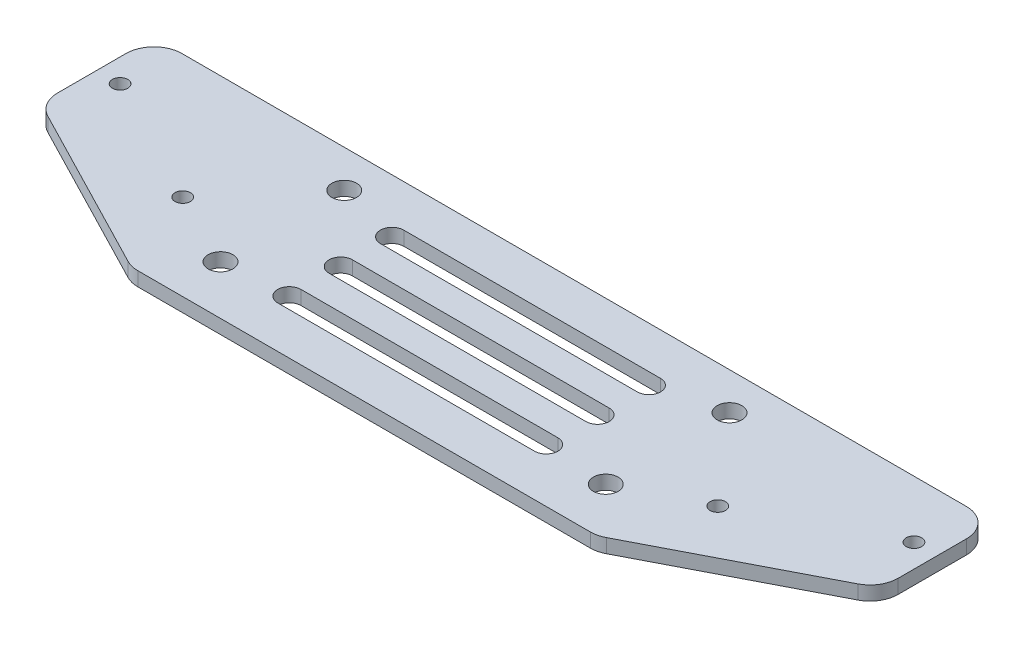
ISO-10303-21;
HEADER;
FILE_DESCRIPTION(('STEP AP214'),'2;1');
FILE_NAME('part.step','',(''),(''),'','','');
FILE_SCHEMA(('AUTOMOTIVE_DESIGN { 1 0 10303 214 1 1 1 1 }'));
ENDSEC;
DATA;
#1=APPLICATION_CONTEXT('core data for automotive mechanical design processes');
#2=APPLICATION_PROTOCOL_DEFINITION('international standard','automotive_design',2000,#1);
#3=PRODUCT_CONTEXT('',#1,'mechanical');
#4=PRODUCT('Part','Part','',(#3));
#5=PRODUCT_RELATED_PRODUCT_CATEGORY('part','',(#4));
#6=PRODUCT_DEFINITION_FORMATION('','',#4);
#7=PRODUCT_DEFINITION_CONTEXT('part definition',#1,'design');
#8=PRODUCT_DEFINITION('design','',#6,#7);
#9=PRODUCT_DEFINITION_SHAPE('','',#8);
#10=(LENGTH_UNIT() NAMED_UNIT(*) SI_UNIT(.MILLI.,.METRE.));
#11=(NAMED_UNIT(*) PLANE_ANGLE_UNIT() SI_UNIT($,.RADIAN.));
#12=(NAMED_UNIT(*) SI_UNIT($,.STERADIAN.) SOLID_ANGLE_UNIT());
#13=UNCERTAINTY_MEASURE_WITH_UNIT(LENGTH_MEASURE(1.E-05),#10,'distance_accuracy_value','');
#14=(GEOMETRIC_REPRESENTATION_CONTEXT(3) GLOBAL_UNCERTAINTY_ASSIGNED_CONTEXT((#13)) GLOBAL_UNIT_ASSIGNED_CONTEXT((#10,
#11,#12)) REPRESENTATION_CONTEXT('',''));
#15=CARTESIAN_POINT('',(0.,0.,0.));
#16=DIRECTION('',(0.,0.,1.));
#17=DIRECTION('',(1.,0.,0.));
#18=AXIS2_PLACEMENT_3D('',#15,#16,#17);
#19=CARTESIAN_POINT('',(0.,3.,0.));
#20=DIRECTION('',(0.,1.,0.));
#21=DIRECTION('',(0.,0.,1.));
#22=AXIS2_PLACEMENT_3D('',#19,#20,#21);
#23=PLANE('',#22);
#24=CARTESIAN_POINT('',(-27.5,3.,-9.75000000000002));
#25=DIRECTION('',(0.,1.,0.));
#26=DIRECTION('',(0.,0.,1.));
#27=AXIS2_PLACEMENT_3D('',#24,#25,#26);
#28=CIRCLE('',#27,2.5);
#29=CARTESIAN_POINT('',(-27.5,3.,-12.25));
#30=VERTEX_POINT('',#29);
#31=CARTESIAN_POINT('',(-27.5,3.,-7.25000000000002));
#32=VERTEX_POINT('',#31);
#33=EDGE_CURVE('E49',#30,#32,#28,.T.);
#34=ORIENTED_EDGE('',*,*,#33,.F.);
#35=DIRECTION('',(-1.,0.,0.));
#36=VECTOR('',#35,1.);
#37=CARTESIAN_POINT('',(-27.5,3.,-12.25));
#38=LINE('',#37,#36);
#39=CARTESIAN_POINT('',(27.5,3.,-12.25));
#40=VERTEX_POINT('',#39);
#41=EDGE_CURVE('E216',#40,#30,#38,.T.);
#42=ORIENTED_EDGE('',*,*,#41,.F.);
#43=CARTESIAN_POINT('',(27.5,3.,-9.75000000000001));
#44=DIRECTION('',(0.,1.,0.));
#45=DIRECTION('',(0.,0.,1.));
#46=AXIS2_PLACEMENT_3D('',#43,#44,#45);
#47=CIRCLE('',#46,2.5);
#48=CARTESIAN_POINT('',(27.5,3.,-7.25000000000001));
#49=VERTEX_POINT('',#48);
#50=EDGE_CURVE('E219',#49,#40,#47,.T.);
#51=ORIENTED_EDGE('',*,*,#50,.F.);
#52=DIRECTION('',(1.,0.,0.));
#53=VECTOR('',#52,1.);
#54=CARTESIAN_POINT('',(-27.5,3.,-7.25000000000002));
#55=LINE('',#54,#53);
#56=EDGE_CURVE('E225',#32,#49,#55,.T.);
#57=ORIENTED_EDGE('',*,*,#56,.F.);
#58=EDGE_LOOP('',(#34,#42,#51,#57));
#59=FACE_BOUND('',#58,.T.);
#60=CARTESIAN_POINT('',(-27.5,3.,1.24999999999998));
#61=DIRECTION('',(0.,1.,0.));
#62=DIRECTION('',(0.,0.,1.));
#63=AXIS2_PLACEMENT_3D('',#60,#61,#62);
#64=CIRCLE('',#63,2.5);
#65=CARTESIAN_POINT('',(-27.5,3.,-1.25000000000002));
#66=VERTEX_POINT('',#65);
#67=CARTESIAN_POINT('',(-27.5,3.,3.74999999999998));
#68=VERTEX_POINT('',#67);
#69=EDGE_CURVE('E57',#66,#68,#64,.T.);
#70=ORIENTED_EDGE('',*,*,#69,.F.);
#71=DIRECTION('',(-1.,0.,0.));
#72=VECTOR('',#71,1.);
#73=CARTESIAN_POINT('',(-27.5,3.,-1.25000000000002));
#74=LINE('',#73,#72);
#75=CARTESIAN_POINT('',(27.5,3.,-1.25000000000003));
#76=VERTEX_POINT('',#75);
#77=EDGE_CURVE('E240',#76,#66,#74,.T.);
#78=ORIENTED_EDGE('',*,*,#77,.F.);
#79=CARTESIAN_POINT('',(27.5,3.,1.24999999999997));
#80=DIRECTION('',(0.,1.,0.));
#81=DIRECTION('',(0.,0.,1.));
#82=AXIS2_PLACEMENT_3D('',#79,#80,#81);
#83=CIRCLE('',#82,2.5);
#84=CARTESIAN_POINT('',(27.5,3.,3.74999999999997));
#85=VERTEX_POINT('',#84);
#86=EDGE_CURVE('E255',#85,#76,#83,.T.);
#87=ORIENTED_EDGE('',*,*,#86,.F.);
#88=DIRECTION('',(1.,0.,0.));
#89=VECTOR('',#88,1.);
#90=CARTESIAN_POINT('',(-27.5,3.,3.74999999999998));
#91=LINE('',#90,#89);
#92=EDGE_CURVE('E251',#68,#85,#91,.T.);
#93=ORIENTED_EDGE('',*,*,#92,.F.);
#94=EDGE_LOOP('',(#70,#78,#87,#93));
#95=FACE_BOUND('',#94,.T.);
#96=CARTESIAN_POINT('',(-27.5,3.,12.25));
#97=DIRECTION('',(0.,1.,0.));
#98=DIRECTION('',(0.,0.,1.));
#99=AXIS2_PLACEMENT_3D('',#96,#97,#98);
#100=CIRCLE('',#99,2.5);
#101=CARTESIAN_POINT('',(-27.5,3.,9.75));
#102=VERTEX_POINT('',#101);
#103=CARTESIAN_POINT('',(-27.5,3.,14.75));
#104=VERTEX_POINT('',#103);
#105=EDGE_CURVE('E280',#102,#104,#100,.T.);
#106=ORIENTED_EDGE('',*,*,#105,.F.);
#107=DIRECTION('',(-1.,0.,0.));
#108=VECTOR('',#107,1.);
#109=CARTESIAN_POINT('',(-27.5,3.,9.75));
#110=LINE('',#109,#108);
#111=CARTESIAN_POINT('',(27.5,3.,9.74999999999999));
#112=VERTEX_POINT('',#111);
#113=EDGE_CURVE('E270',#112,#102,#110,.T.);
#114=ORIENTED_EDGE('',*,*,#113,.F.);
#115=CARTESIAN_POINT('',(27.5,3.,12.25));
#116=DIRECTION('',(0.,1.,0.));
#117=DIRECTION('',(0.,0.,1.));
#118=AXIS2_PLACEMENT_3D('',#115,#116,#117);
#119=CIRCLE('',#118,2.5);
#120=CARTESIAN_POINT('',(27.5,3.,14.75));
#121=VERTEX_POINT('',#120);
#122=EDGE_CURVE('E285',#121,#112,#119,.T.);
#123=ORIENTED_EDGE('',*,*,#122,.F.);
#124=DIRECTION('',(1.,0.,0.));
#125=VECTOR('',#124,1.);
#126=CARTESIAN_POINT('',(-27.5,3.,14.75));
#127=LINE('',#126,#125);
#128=EDGE_CURVE('E282',#104,#121,#127,.T.);
#129=ORIENTED_EDGE('',*,*,#128,.F.);
#130=EDGE_LOOP('',(#106,#114,#123,#129));
#131=FACE_BOUND('',#130,.T.);
#132=DIRECTION('',(1.,0.,0.));
#133=VECTOR('',#132,1.);
#134=CARTESIAN_POINT('',(-90.,3.,23.75));
#135=LINE('',#134,#133);
#136=CARTESIAN_POINT('',(-48.4432659156992,3.,23.75));
#137=VERTEX_POINT('',#136);
#138=CARTESIAN_POINT('',(48.4432659156991,3.,23.75));
#139=VERTEX_POINT('',#138);
#140=EDGE_CURVE('E367',#137,#139,#135,.T.);
#141=ORIENTED_EDGE('',*,*,#140,.T.);
#142=CARTESIAN_POINT('',(48.4432659156992,3.,17.75));
#143=DIRECTION('',(0.,1.,0.));
#144=DIRECTION('',(0.,0.,1.));
#145=AXIS2_PLACEMENT_3D('',#142,#143,#144);
#146=CIRCLE('',#145,6.);
#147=CARTESIAN_POINT('',(51.1956136961503,3.,23.0814708754194));
#148=VERTEX_POINT('',#147);
#149=EDGE_CURVE('E395',#139,#148,#146,.T.);
#150=ORIENTED_EDGE('',*,*,#149,.T.);
#151=DIRECTION('',(-0.888578479236569,0.,0.458724630075197));
#152=VECTOR('',#151,1.);
#153=CARTESIAN_POINT('',(49.9006307065782,3.,23.75));
#154=LINE('',#153,#152);
#155=CARTESIAN_POINT('',(86.7523477804512,3.,4.72546735897526));
#156=VERTEX_POINT('',#155);
#157=EDGE_CURVE('E232',#156,#148,#154,.T.);
#158=ORIENTED_EDGE('',*,*,#157,.F.);
#159=CARTESIAN_POINT('',(84.,3.,-0.606003516444145));
#160=DIRECTION('',(0.,1.,0.));
#161=DIRECTION('',(0.,0.,1.));
#162=AXIS2_PLACEMENT_3D('',#159,#160,#161);
#163=CIRCLE('',#162,6.);
#164=CARTESIAN_POINT('',(90.0000000000001,3.,-0.606003516444149));
#165=VERTEX_POINT('',#164);
#166=EDGE_CURVE('E393',#156,#165,#163,.T.);
#167=ORIENTED_EDGE('',*,*,#166,.T.);
#168=DIRECTION('',(0.,0.,-1.));
#169=VECTOR('',#168,1.);
#170=CARTESIAN_POINT('',(90.0000000000001,3.,-21.25));
#171=LINE('',#170,#169);
#172=CARTESIAN_POINT('',(90.0000000000001,3.,-15.25));
#173=VERTEX_POINT('',#172);
#174=EDGE_CURVE('E357',#165,#173,#171,.T.);
#175=ORIENTED_EDGE('',*,*,#174,.T.);
#176=CARTESIAN_POINT('',(84.,3.,-15.25));
#177=DIRECTION('',(0.,1.,0.));
#178=DIRECTION('',(0.,0.,1.));
#179=AXIS2_PLACEMENT_3D('',#176,#177,#178);
#180=CIRCLE('',#179,6.);
#181=CARTESIAN_POINT('',(84.,3.,-21.25));
#182=VERTEX_POINT('',#181);
#183=EDGE_CURVE('E391',#173,#182,#180,.T.);
#184=ORIENTED_EDGE('',*,*,#183,.T.);
#185=DIRECTION('',(-1.,0.,0.));
#186=VECTOR('',#185,1.);
#187=CARTESIAN_POINT('',(-90.,3.,-21.25));
#188=LINE('',#187,#186);
#189=CARTESIAN_POINT('',(-84.,3.,-21.25));
#190=VERTEX_POINT('',#189);
#191=EDGE_CURVE('E360',#182,#190,#188,.T.);
#192=ORIENTED_EDGE('',*,*,#191,.T.);
#193=CARTESIAN_POINT('',(-84.,3.,-15.25));
#194=DIRECTION('',(0.,1.,0.));
#195=DIRECTION('',(0.,0.,1.));
#196=AXIS2_PLACEMENT_3D('',#193,#194,#195);
#197=CIRCLE('',#196,6.);
#198=CARTESIAN_POINT('',(-90.,3.,-15.25));
#199=VERTEX_POINT('',#198);
#200=EDGE_CURVE('E389',#190,#199,#197,.T.);
#201=ORIENTED_EDGE('',*,*,#200,.T.);
#202=DIRECTION('',(0.,0.,1.));
#203=VECTOR('',#202,1.);
#204=CARTESIAN_POINT('',(-90.,3.,-21.25));
#205=LINE('',#204,#203);
#206=CARTESIAN_POINT('',(-90.,3.,-0.606003516444093));
#207=VERTEX_POINT('',#206);
#208=EDGE_CURVE('E364',#199,#207,#205,.T.);
#209=ORIENTED_EDGE('',*,*,#208,.T.);
#210=CARTESIAN_POINT('',(-84.,3.,-0.60600351644409));
#211=DIRECTION('',(0.,1.,0.));
#212=DIRECTION('',(0.,0.,1.));
#213=AXIS2_PLACEMENT_3D('',#210,#211,#212);
#214=CIRCLE('',#213,6.);
#215=CARTESIAN_POINT('',(-86.7523477804512,3.,4.72546735897532));
#216=VERTEX_POINT('',#215);
#217=EDGE_CURVE('E385',#207,#216,#214,.T.);
#218=ORIENTED_EDGE('',*,*,#217,.T.);
#219=DIRECTION('',(-0.888578479236569,0.,-0.458724630075196));
#220=VECTOR('',#219,1.);
#221=CARTESIAN_POINT('',(-49.9006307065782,3.,23.75));
#222=LINE('',#221,#220);
#223=CARTESIAN_POINT('',(-51.1956136961503,3.,23.0814708754194));
#224=VERTEX_POINT('',#223);
#225=EDGE_CURVE('E301',#224,#216,#222,.T.);
#226=ORIENTED_EDGE('',*,*,#225,.F.);
#227=CARTESIAN_POINT('',(-48.4432659156992,3.,17.75));
#228=DIRECTION('',(0.,1.,0.));
#229=DIRECTION('',(0.,0.,1.));
#230=AXIS2_PLACEMENT_3D('',#227,#228,#229);
#231=CIRCLE('',#230,6.);
#232=EDGE_CURVE('E387',#224,#137,#231,.T.);
#233=ORIENTED_EDGE('',*,*,#232,.T.);
#234=EDGE_LOOP('',(#141,#150,#158,#167,#175,#184,#192,#201,#209,#218,#226,#233));
#235=FACE_BOUND('',#234,.T.);
#236=CARTESIAN_POINT('',(-85.,3.,-8.99999999999999));
#237=DIRECTION('',(0.,1.,0.));
#238=DIRECTION('',(0.,0.,1.));
#239=AXIS2_PLACEMENT_3D('',#236,#237,#238);
#240=CIRCLE('',#239,1.65);
#241=CARTESIAN_POINT('',(-85.,3.,-7.34999999999999));
#242=VERTEX_POINT('',#241);
#243=EDGE_CURVE('E313',#242,#242,#240,.T.);
#244=ORIENTED_EDGE('',*,*,#243,.F.);
#245=EDGE_LOOP('',(#244));
#246=FACE_BOUND('',#245,.T.);
#247=CARTESIAN_POINT('',(57.3,3.,5.29999999999999));
#248=DIRECTION('',(0.,1.,0.));
#249=DIRECTION('',(0.,0.,-1.));
#250=AXIS2_PLACEMENT_3D('',#247,#248,#249);
#251=CIRCLE('',#250,1.65);
#252=CARTESIAN_POINT('',(57.3,3.,3.65));
#253=VERTEX_POINT('',#252);
#254=EDGE_CURVE('E300',#253,#253,#251,.T.);
#255=ORIENTED_EDGE('',*,*,#254,.F.);
#256=EDGE_LOOP('',(#255));
#257=FACE_BOUND('',#256,.T.);
#258=CARTESIAN_POINT('',(-57.3,3.,5.30000000000001));
#259=DIRECTION('',(0.,1.,0.));
#260=DIRECTION('',(0.,0.,1.));
#261=AXIS2_PLACEMENT_3D('',#258,#259,#260);
#262=CIRCLE('',#261,1.65);
#263=CARTESIAN_POINT('',(-57.3,3.,6.95));
#264=VERTEX_POINT('',#263);
#265=EDGE_CURVE('E320',#264,#264,#262,.T.);
#266=ORIENTED_EDGE('',*,*,#265,.F.);
#267=EDGE_LOOP('',(#266));
#268=FACE_BOUND('',#267,.T.);
#269=CARTESIAN_POINT('',(85.,3.,-9.00000000000001));
#270=DIRECTION('',(0.,1.,0.));
#271=DIRECTION('',(0.,0.,-1.));
#272=AXIS2_PLACEMENT_3D('',#269,#270,#271);
#273=CIRCLE('',#272,1.65);
#274=CARTESIAN_POINT('',(85.,3.,-10.65));
#275=VERTEX_POINT('',#274);
#276=EDGE_CURVE('E325',#275,#275,#273,.T.);
#277=ORIENTED_EDGE('',*,*,#276,.F.);
#278=EDGE_LOOP('',(#277));
#279=FACE_BOUND('',#278,.T.);
#280=CARTESIAN_POINT('',(-41.25,3.,13.25));
#281=DIRECTION('',(0.,1.,0.));
#282=DIRECTION('',(0.,0.,1.));
#283=AXIS2_PLACEMENT_3D('',#280,#281,#282);
#284=CIRCLE('',#283,2.65);
#285=CARTESIAN_POINT('',(-41.25,3.,15.9));
#286=VERTEX_POINT('',#285);
#287=EDGE_CURVE('E339',#286,#286,#284,.T.);
#288=ORIENTED_EDGE('',*,*,#287,.F.);
#289=EDGE_LOOP('',(#288));
#290=FACE_BOUND('',#289,.T.);
#291=CARTESIAN_POINT('',(-41.25,3.,-13.25));
#292=DIRECTION('',(0.,1.,0.));
#293=DIRECTION('',(0.,0.,1.));
#294=AXIS2_PLACEMENT_3D('',#291,#292,#293);
#295=CIRCLE('',#294,2.65);
#296=CARTESIAN_POINT('',(-41.25,3.,-10.6));
#297=VERTEX_POINT('',#296);
#298=EDGE_CURVE('E351',#297,#297,#295,.T.);
#299=ORIENTED_EDGE('',*,*,#298,.F.);
#300=EDGE_LOOP('',(#299));
#301=FACE_BOUND('',#300,.T.);
#302=CARTESIAN_POINT('',(41.25,3.,-13.25));
#303=DIRECTION('',(0.,1.,0.));
#304=DIRECTION('',(0.,0.,1.));
#305=AXIS2_PLACEMENT_3D('',#302,#303,#304);
#306=CIRCLE('',#305,2.65);
#307=CARTESIAN_POINT('',(41.25,3.,-10.6));
#308=VERTEX_POINT('',#307);
#309=EDGE_CURVE('E345',#308,#308,#306,.T.);
#310=ORIENTED_EDGE('',*,*,#309,.F.);
#311=EDGE_LOOP('',(#310));
#312=FACE_BOUND('',#311,.T.);
#313=CARTESIAN_POINT('',(41.25,3.,13.25));
#314=DIRECTION('',(0.,1.,0.));
#315=DIRECTION('',(0.,0.,1.));
#316=AXIS2_PLACEMENT_3D('',#313,#314,#315);
#317=CIRCLE('',#316,2.65);
#318=CARTESIAN_POINT('',(41.25,3.,15.9));
#319=VERTEX_POINT('',#318);
#320=EDGE_CURVE('E333',#319,#319,#317,.T.);
#321=ORIENTED_EDGE('',*,*,#320,.F.);
#322=EDGE_LOOP('',(#321));
#323=FACE_BOUND('',#322,.T.);
#324=ADVANCED_FACE('F34',(#59,#95,#131,#235,#246,#257,#268,#279,#290,#301,#312,#323),#23,.T.);
#325=CARTESIAN_POINT('',(0.,0.,0.));
#326=DIRECTION('',(0.,1.,0.));
#327=DIRECTION('',(0.,0.,1.));
#328=AXIS2_PLACEMENT_3D('',#325,#326,#327);
#329=PLANE('',#328);
#330=DIRECTION('',(-1.,0.,0.));
#331=VECTOR('',#330,1.);
#332=CARTESIAN_POINT('',(-27.5,0.,-12.25));
#333=LINE('',#332,#331);
#334=CARTESIAN_POINT('',(27.5,0.,-12.25));
#335=VERTEX_POINT('',#334);
#336=CARTESIAN_POINT('',(-27.5,0.,-12.25));
#337=VERTEX_POINT('',#336);
#338=EDGE_CURVE('E203',#335,#337,#333,.T.);
#339=ORIENTED_EDGE('',*,*,#338,.T.);
#340=CARTESIAN_POINT('',(-27.5,0.,-9.75000000000002));
#341=DIRECTION('',(0.,1.,0.));
#342=DIRECTION('',(0.,0.,1.));
#343=AXIS2_PLACEMENT_3D('',#340,#341,#342);
#344=CIRCLE('',#343,2.5);
#345=CARTESIAN_POINT('',(-27.5,0.,-7.25000000000002));
#346=VERTEX_POINT('',#345);
#347=EDGE_CURVE('E197',#337,#346,#344,.T.);
#348=ORIENTED_EDGE('',*,*,#347,.T.);
#349=DIRECTION('',(1.,0.,0.));
#350=VECTOR('',#349,1.);
#351=CARTESIAN_POINT('',(-27.5,0.,-7.25000000000002));
#352=LINE('',#351,#350);
#353=CARTESIAN_POINT('',(27.5,0.,-7.25000000000003));
#354=VERTEX_POINT('',#353);
#355=EDGE_CURVE('E207',#346,#354,#352,.T.);
#356=ORIENTED_EDGE('',*,*,#355,.T.);
#357=CARTESIAN_POINT('',(27.5,0.,-9.75000000000001));
#358=DIRECTION('',(0.,1.,0.));
#359=DIRECTION('',(0.,0.,1.));
#360=AXIS2_PLACEMENT_3D('',#357,#358,#359);
#361=CIRCLE('',#360,2.5);
#362=EDGE_CURVE('E211',#354,#335,#361,.T.);
#363=ORIENTED_EDGE('',*,*,#362,.T.);
#364=EDGE_LOOP('',(#339,#348,#356,#363));
#365=FACE_BOUND('',#364,.T.);
#366=DIRECTION('',(-1.,0.,0.));
#367=VECTOR('',#366,1.);
#368=CARTESIAN_POINT('',(-27.5,0.,-1.25000000000002));
#369=LINE('',#368,#367);
#370=CARTESIAN_POINT('',(27.5,0.,-1.25000000000003));
#371=VERTEX_POINT('',#370);
#372=CARTESIAN_POINT('',(-27.5,0.,-1.25000000000002));
#373=VERTEX_POINT('',#372);
#374=EDGE_CURVE('E246',#371,#373,#369,.T.);
#375=ORIENTED_EDGE('',*,*,#374,.T.);
#376=CARTESIAN_POINT('',(-27.5,0.,1.24999999999998));
#377=DIRECTION('',(0.,1.,0.));
#378=DIRECTION('',(0.,0.,1.));
#379=AXIS2_PLACEMENT_3D('',#376,#377,#378);
#380=CIRCLE('',#379,2.5);
#381=CARTESIAN_POINT('',(-27.5,0.,3.74999999999998));
#382=VERTEX_POINT('',#381);
#383=EDGE_CURVE('E236',#373,#382,#380,.T.);
#384=ORIENTED_EDGE('',*,*,#383,.T.);
#385=DIRECTION('',(1.,0.,0.));
#386=VECTOR('',#385,1.);
#387=CARTESIAN_POINT('',(-27.5,0.,3.74999999999998));
#388=LINE('',#387,#386);
#389=CARTESIAN_POINT('',(27.5,0.,3.74999999999997));
#390=VERTEX_POINT('',#389);
#391=EDGE_CURVE('E239',#382,#390,#388,.T.);
#392=ORIENTED_EDGE('',*,*,#391,.T.);
#393=CARTESIAN_POINT('',(27.5,0.,1.24999999999997));
#394=DIRECTION('',(0.,1.,0.));
#395=DIRECTION('',(0.,0.,1.));
#396=AXIS2_PLACEMENT_3D('',#393,#394,#395);
#397=CIRCLE('',#396,2.5);
#398=EDGE_CURVE('E243',#390,#371,#397,.T.);
#399=ORIENTED_EDGE('',*,*,#398,.T.);
#400=EDGE_LOOP('',(#375,#384,#392,#399));
#401=FACE_BOUND('',#400,.T.);
#402=DIRECTION('',(-1.,0.,0.));
#403=VECTOR('',#402,1.);
#404=CARTESIAN_POINT('',(-27.5,0.,9.75));
#405=LINE('',#404,#403);
#406=CARTESIAN_POINT('',(27.5,0.,9.74999999999999));
#407=VERTEX_POINT('',#406);
#408=CARTESIAN_POINT('',(-27.5,0.,9.75));
#409=VERTEX_POINT('',#408);
#410=EDGE_CURVE('E276',#407,#409,#405,.T.);
#411=ORIENTED_EDGE('',*,*,#410,.T.);
#412=CARTESIAN_POINT('',(-27.5,0.,12.25));
#413=DIRECTION('',(0.,1.,0.));
#414=DIRECTION('',(0.,0.,1.));
#415=AXIS2_PLACEMENT_3D('',#412,#413,#414);
#416=CIRCLE('',#415,2.5);
#417=CARTESIAN_POINT('',(-27.5,0.,14.75));
#418=VERTEX_POINT('',#417);
#419=EDGE_CURVE('E266',#409,#418,#416,.T.);
#420=ORIENTED_EDGE('',*,*,#419,.T.);
#421=DIRECTION('',(1.,0.,0.));
#422=VECTOR('',#421,1.);
#423=CARTESIAN_POINT('',(-27.5,0.,14.75));
#424=LINE('',#423,#422);
#425=CARTESIAN_POINT('',(27.5,0.,14.75));
#426=VERTEX_POINT('',#425);
#427=EDGE_CURVE('E269',#418,#426,#424,.T.);
#428=ORIENTED_EDGE('',*,*,#427,.T.);
#429=CARTESIAN_POINT('',(27.5,0.,12.25));
#430=DIRECTION('',(0.,1.,0.));
#431=DIRECTION('',(0.,0.,1.));
#432=AXIS2_PLACEMENT_3D('',#429,#430,#431);
#433=CIRCLE('',#432,2.5);
#434=EDGE_CURVE('E273',#426,#407,#433,.T.);
#435=ORIENTED_EDGE('',*,*,#434,.T.);
#436=EDGE_LOOP('',(#411,#420,#428,#435));
#437=FACE_BOUND('',#436,.T.);
#438=CARTESIAN_POINT('',(-85.,0.,-8.99999999999999));
#439=DIRECTION('',(0.,1.,0.));
#440=DIRECTION('',(0.,0.,1.));
#441=AXIS2_PLACEMENT_3D('',#438,#439,#440);
#442=CIRCLE('',#441,1.65);
#443=CARTESIAN_POINT('',(-85.,0.,-7.34999999999999));
#444=VERTEX_POINT('',#443);
#445=EDGE_CURVE('E309',#444,#444,#442,.T.);
#446=ORIENTED_EDGE('',*,*,#445,.T.);
#447=EDGE_LOOP('',(#446));
#448=FACE_BOUND('',#447,.T.);
#449=CARTESIAN_POINT('',(57.3,0.,5.29999999999999));
#450=DIRECTION('',(0.,1.,0.));
#451=DIRECTION('',(0.,0.,-1.));
#452=AXIS2_PLACEMENT_3D('',#449,#450,#451);
#453=CIRCLE('',#452,1.65);
#454=CARTESIAN_POINT('',(57.3,0.,3.65));
#455=VERTEX_POINT('',#454);
#456=EDGE_CURVE('E317',#455,#455,#453,.T.);
#457=ORIENTED_EDGE('',*,*,#456,.T.);
#458=EDGE_LOOP('',(#457));
#459=FACE_BOUND('',#458,.T.);
#460=CARTESIAN_POINT('',(-57.3,0.,5.30000000000001));
#461=DIRECTION('',(0.,1.,0.));
#462=DIRECTION('',(0.,0.,1.));
#463=AXIS2_PLACEMENT_3D('',#460,#461,#462);
#464=CIRCLE('',#463,1.65);
#465=CARTESIAN_POINT('',(-57.3,0.,6.95));
#466=VERTEX_POINT('',#465);
#467=EDGE_CURVE('E328',#466,#466,#464,.T.);
#468=ORIENTED_EDGE('',*,*,#467,.T.);
#469=EDGE_LOOP('',(#468));
#470=FACE_BOUND('',#469,.T.);
#471=CARTESIAN_POINT('',(85.,0.,-9.00000000000001));
#472=DIRECTION('',(0.,1.,0.));
#473=DIRECTION('',(0.,0.,-1.));
#474=AXIS2_PLACEMENT_3D('',#471,#472,#473);
#475=CIRCLE('',#474,1.65);
#476=CARTESIAN_POINT('',(85.,0.,-10.65));
#477=VERTEX_POINT('',#476);
#478=EDGE_CURVE('E316',#477,#477,#475,.T.);
#479=ORIENTED_EDGE('',*,*,#478,.T.);
#480=EDGE_LOOP('',(#479));
#481=FACE_BOUND('',#480,.T.);
#482=DIRECTION('',(-0.888578479236569,0.,0.458724630075197));
#483=VECTOR('',#482,1.);
#484=CARTESIAN_POINT('',(49.9006307065782,0.,23.75));
#485=LINE('',#484,#483);
#486=CARTESIAN_POINT('',(86.7523477804512,0.,4.72546735897526));
#487=VERTEX_POINT('',#486);
#488=CARTESIAN_POINT('',(51.1956136961503,0.,23.0814708754194));
#489=VERTEX_POINT('',#488);
#490=EDGE_CURVE('E304',#487,#489,#485,.T.);
#491=ORIENTED_EDGE('',*,*,#490,.T.);
#492=CARTESIAN_POINT('',(48.4432659156992,0.,17.75));
#493=DIRECTION('',(0.,1.,0.));
#494=DIRECTION('',(0.,0.,1.));
#495=AXIS2_PLACEMENT_3D('',#492,#493,#494);
#496=CIRCLE('',#495,6.);
#497=CARTESIAN_POINT('',(48.4432659156991,0.,23.75));
#498=VERTEX_POINT('',#497);
#499=EDGE_CURVE('E412',#489,#498,#496,.F.);
#500=ORIENTED_EDGE('',*,*,#499,.T.);
#501=DIRECTION('',(1.,0.,0.));
#502=VECTOR('',#501,1.);
#503=CARTESIAN_POINT('',(-90.,0.,23.75));
#504=LINE('',#503,#502);
#505=CARTESIAN_POINT('',(-48.4432659156992,0.,23.75));
#506=VERTEX_POINT('',#505);
#507=EDGE_CURVE('E361',#506,#498,#504,.T.);
#508=ORIENTED_EDGE('',*,*,#507,.F.);
#509=CARTESIAN_POINT('',(-48.4432659156992,0.,17.75));
#510=DIRECTION('',(0.,1.,0.));
#511=DIRECTION('',(0.,0.,1.));
#512=AXIS2_PLACEMENT_3D('',#509,#510,#511);
#513=CIRCLE('',#512,6.);
#514=CARTESIAN_POINT('',(-51.1956136961503,0.,23.0814708754194));
#515=VERTEX_POINT('',#514);
#516=EDGE_CURVE('E404',#506,#515,#513,.F.);
#517=ORIENTED_EDGE('',*,*,#516,.T.);
#518=DIRECTION('',(-0.888578479236569,0.,-0.458724630075196));
#519=VECTOR('',#518,1.);
#520=CARTESIAN_POINT('',(-49.9006307065782,0.,23.75));
#521=LINE('',#520,#519);
#522=CARTESIAN_POINT('',(-86.7523477804512,0.,4.72546735897532));
#523=VERTEX_POINT('',#522);
#524=EDGE_CURVE('E297',#515,#523,#521,.T.);
#525=ORIENTED_EDGE('',*,*,#524,.T.);
#526=CARTESIAN_POINT('',(-84.,0.,-0.60600351644409));
#527=DIRECTION('',(0.,1.,0.));
#528=DIRECTION('',(0.,0.,1.));
#529=AXIS2_PLACEMENT_3D('',#526,#527,#528);
#530=CIRCLE('',#529,6.);
#531=CARTESIAN_POINT('',(-90.,0.,-0.606003516444093));
#532=VERTEX_POINT('',#531);
#533=EDGE_CURVE('E402',#523,#532,#530,.F.);
#534=ORIENTED_EDGE('',*,*,#533,.T.);
#535=DIRECTION('',(0.,0.,1.));
#536=VECTOR('',#535,1.);
#537=CARTESIAN_POINT('',(-90.,0.,-21.25));
#538=LINE('',#537,#536);
#539=CARTESIAN_POINT('',(-90.,0.,-15.25));
#540=VERTEX_POINT('',#539);
#541=EDGE_CURVE('E376',#540,#532,#538,.T.);
#542=ORIENTED_EDGE('',*,*,#541,.F.);
#543=CARTESIAN_POINT('',(-84.,0.,-15.25));
#544=DIRECTION('',(0.,1.,0.));
#545=DIRECTION('',(0.,0.,1.));
#546=AXIS2_PLACEMENT_3D('',#543,#544,#545);
#547=CIRCLE('',#546,6.);
#548=CARTESIAN_POINT('',(-84.,0.,-21.25));
#549=VERTEX_POINT('',#548);
#550=EDGE_CURVE('E406',#540,#549,#547,.F.);
#551=ORIENTED_EDGE('',*,*,#550,.T.);
#552=DIRECTION('',(-1.,0.,0.));
#553=VECTOR('',#552,1.);
#554=CARTESIAN_POINT('',(-90.,0.,-21.25));
#555=LINE('',#554,#553);
#556=CARTESIAN_POINT('',(84.,0.,-21.25));
#557=VERTEX_POINT('',#556);
#558=EDGE_CURVE('E373',#557,#549,#555,.T.);
#559=ORIENTED_EDGE('',*,*,#558,.F.);
#560=CARTESIAN_POINT('',(84.,0.,-15.25));
#561=DIRECTION('',(0.,1.,0.));
#562=DIRECTION('',(0.,0.,1.));
#563=AXIS2_PLACEMENT_3D('',#560,#561,#562);
#564=CIRCLE('',#563,6.);
#565=CARTESIAN_POINT('',(90.0000000000001,0.,-15.25));
#566=VERTEX_POINT('',#565);
#567=EDGE_CURVE('E408',#557,#566,#564,.F.);
#568=ORIENTED_EDGE('',*,*,#567,.T.);
#569=DIRECTION('',(0.,0.,-1.));
#570=VECTOR('',#569,1.);
#571=CARTESIAN_POINT('',(90.0000000000001,0.,-21.25));
#572=LINE('',#571,#570);
#573=CARTESIAN_POINT('',(90.0000000000001,0.,-0.606003516444149));
#574=VERTEX_POINT('',#573);
#575=EDGE_CURVE('E354',#574,#566,#572,.T.);
#576=ORIENTED_EDGE('',*,*,#575,.F.);
#577=CARTESIAN_POINT('',(84.,0.,-0.606003516444145));
#578=DIRECTION('',(0.,1.,0.));
#579=DIRECTION('',(0.,0.,1.));
#580=AXIS2_PLACEMENT_3D('',#577,#578,#579);
#581=CIRCLE('',#580,6.);
#582=EDGE_CURVE('E410',#574,#487,#581,.F.);
#583=ORIENTED_EDGE('',*,*,#582,.T.);
#584=EDGE_LOOP('',(#491,#500,#508,#517,#525,#534,#542,#551,#559,#568,#576,#583));
#585=FACE_BOUND('',#584,.T.);
#586=CARTESIAN_POINT('',(-41.25,0.,-13.25));
#587=DIRECTION('',(0.,1.,0.));
#588=DIRECTION('',(0.,0.,1.));
#589=AXIS2_PLACEMENT_3D('',#586,#587,#588);
#590=CIRCLE('',#589,2.65);
#591=CARTESIAN_POINT('',(-41.25,0.,-10.6));
#592=VERTEX_POINT('',#591);
#593=EDGE_CURVE('E348',#592,#592,#590,.T.);
#594=ORIENTED_EDGE('',*,*,#593,.T.);
#595=EDGE_LOOP('',(#594));
#596=FACE_BOUND('',#595,.T.);
#597=CARTESIAN_POINT('',(41.25,0.,-13.25));
#598=DIRECTION('',(0.,1.,0.));
#599=DIRECTION('',(0.,0.,1.));
#600=AXIS2_PLACEMENT_3D('',#597,#598,#599);
#601=CIRCLE('',#600,2.65);
#602=CARTESIAN_POINT('',(41.25,0.,-10.6));
#603=VERTEX_POINT('',#602);
#604=EDGE_CURVE('E342',#603,#603,#601,.T.);
#605=ORIENTED_EDGE('',*,*,#604,.T.);
#606=EDGE_LOOP('',(#605));
#607=FACE_BOUND('',#606,.T.);
#608=CARTESIAN_POINT('',(-41.25,0.,13.25));
#609=DIRECTION('',(0.,1.,0.));
#610=DIRECTION('',(0.,0.,1.));
#611=AXIS2_PLACEMENT_3D('',#608,#609,#610);
#612=CIRCLE('',#611,2.65);
#613=CARTESIAN_POINT('',(-41.25,0.,15.9));
#614=VERTEX_POINT('',#613);
#615=EDGE_CURVE('E336',#614,#614,#612,.T.);
#616=ORIENTED_EDGE('',*,*,#615,.T.);
#617=EDGE_LOOP('',(#616));
#618=FACE_BOUND('',#617,.T.);
#619=CARTESIAN_POINT('',(41.25,0.,13.25));
#620=DIRECTION('',(0.,1.,0.));
#621=DIRECTION('',(0.,0.,1.));
#622=AXIS2_PLACEMENT_3D('',#619,#620,#621);
#623=CIRCLE('',#622,2.65);
#624=CARTESIAN_POINT('',(41.25,0.,15.9));
#625=VERTEX_POINT('',#624);
#626=EDGE_CURVE('E312',#625,#625,#623,.T.);
#627=ORIENTED_EDGE('',*,*,#626,.T.);
#628=EDGE_LOOP('',(#627));
#629=FACE_BOUND('',#628,.T.);
#630=ADVANCED_FACE('F213',(#365,#401,#437,#448,#459,#470,#481,#585,#596,#607,#618,#629),#329,.F.);
#631=CARTESIAN_POINT('',(90.0000000000001,3.,-21.25));
#632=DIRECTION('',(-1.,0.,0.));
#633=DIRECTION('',(0.,0.,1.));
#634=AXIS2_PLACEMENT_3D('',#631,#632,#633);
#635=PLANE('',#634);
#636=ORIENTED_EDGE('',*,*,#174,.F.);
#637=DIRECTION('',(0.,1.,0.));
#638=VECTOR('',#637,1.);
#639=CARTESIAN_POINT('',(90.0000000000001,3.,-0.606003516444142));
#640=LINE('',#639,#638);
#641=EDGE_CURVE('E416',#165,#574,#640,.F.);
#642=ORIENTED_EDGE('',*,*,#641,.T.);
#643=ORIENTED_EDGE('',*,*,#575,.T.);
#644=DIRECTION('',(0.,-1.,0.));
#645=VECTOR('',#644,1.);
#646=CARTESIAN_POINT('',(90.0000000000001,3.,-15.25));
#647=LINE('',#646,#645);
#648=EDGE_CURVE('E414',#566,#173,#647,.F.);
#649=ORIENTED_EDGE('',*,*,#648,.T.);
#650=EDGE_LOOP('',(#636,#642,#643,#649));
#651=FACE_BOUND('',#650,.T.);
#652=ADVANCED_FACE('F465',(#651),#635,.F.);
#653=CARTESIAN_POINT('',(-90.,3.,-21.25));
#654=DIRECTION('',(0.,0.,1.));
#655=DIRECTION('',(1.,0.,0.));
#656=AXIS2_PLACEMENT_3D('',#653,#654,#655);
#657=PLANE('',#656);
#658=ORIENTED_EDGE('',*,*,#191,.F.);
#659=DIRECTION('',(0.,-1.,0.));
#660=VECTOR('',#659,1.);
#661=CARTESIAN_POINT('',(84.,3.,-21.25));
#662=LINE('',#661,#660);
#663=EDGE_CURVE('E420',#182,#557,#662,.T.);
#664=ORIENTED_EDGE('',*,*,#663,.T.);
#665=ORIENTED_EDGE('',*,*,#558,.T.);
#666=DIRECTION('',(0.,-1.,0.));
#667=VECTOR('',#666,1.);
#668=CARTESIAN_POINT('',(-84.,3.,-21.25));
#669=LINE('',#668,#667);
#670=EDGE_CURVE('E418',#549,#190,#669,.F.);
#671=ORIENTED_EDGE('',*,*,#670,.T.);
#672=EDGE_LOOP('',(#658,#664,#665,#671));
#673=FACE_BOUND('',#672,.T.);
#674=ADVANCED_FACE('F455',(#673),#657,.F.);
#675=CARTESIAN_POINT('',(-90.,3.,-21.25));
#676=DIRECTION('',(1.,0.,0.));
#677=DIRECTION('',(0.,0.,-1.));
#678=AXIS2_PLACEMENT_3D('',#675,#676,#677);
#679=PLANE('',#678);
#680=ORIENTED_EDGE('',*,*,#208,.F.);
#681=DIRECTION('',(0.,-1.,0.));
#682=VECTOR('',#681,1.);
#683=CARTESIAN_POINT('',(-90.,3.,-15.25));
#684=LINE('',#683,#682);
#685=EDGE_CURVE('E426',#199,#540,#684,.T.);
#686=ORIENTED_EDGE('',*,*,#685,.T.);
#687=ORIENTED_EDGE('',*,*,#541,.T.);
#688=DIRECTION('',(0.,1.,0.));
#689=VECTOR('',#688,1.);
#690=CARTESIAN_POINT('',(-90.,3.,-0.606003516444086));
#691=LINE('',#690,#689);
#692=EDGE_CURVE('E423',#532,#207,#691,.T.);
#693=ORIENTED_EDGE('',*,*,#692,.T.);
#694=EDGE_LOOP('',(#680,#686,#687,#693));
#695=FACE_BOUND('',#694,.T.);
#696=ADVANCED_FACE('F444',(#695),#679,.F.);
#697=CARTESIAN_POINT('',(-90.,3.,23.75));
#698=DIRECTION('',(0.,0.,-1.));
#699=DIRECTION('',(-1.,0.,0.));
#700=AXIS2_PLACEMENT_3D('',#697,#698,#699);
#701=PLANE('',#700);
#702=ORIENTED_EDGE('',*,*,#507,.T.);
#703=DIRECTION('',(0.,1.,0.));
#704=VECTOR('',#703,1.);
#705=CARTESIAN_POINT('',(48.4432659156992,3.,23.75));
#706=LINE('',#705,#704);
#707=EDGE_CURVE('E382',#498,#139,#706,.T.);
#708=ORIENTED_EDGE('',*,*,#707,.T.);
#709=ORIENTED_EDGE('',*,*,#140,.F.);
#710=DIRECTION('',(0.,1.,0.));
#711=VECTOR('',#710,1.);
#712=CARTESIAN_POINT('',(-48.4432659156992,3.,23.75));
#713=LINE('',#712,#711);
#714=EDGE_CURVE('E370',#137,#506,#713,.F.);
#715=ORIENTED_EDGE('',*,*,#714,.T.);
#716=EDGE_LOOP('',(#702,#708,#709,#715));
#717=FACE_BOUND('',#716,.T.);
#718=ADVANCED_FACE('F480',(#717),#701,.F.);
#719=CARTESIAN_POINT('',(-41.25,3.,-13.25));
#720=DIRECTION('',(0.,-1.,0.));
#721=DIRECTION('',(0.,0.,-1.));
#722=AXIS2_PLACEMENT_3D('',#719,#720,#721);
#723=CYLINDRICAL_SURFACE('',#722,2.65);
#724=ORIENTED_EDGE('',*,*,#298,.T.);
#725=EDGE_LOOP('',(#724));
#726=FACE_BOUND('',#725,.T.);
#727=ORIENTED_EDGE('',*,*,#593,.F.);
#728=EDGE_LOOP('',(#727));
#729=FACE_BOUND('',#728,.T.);
#730=ADVANCED_FACE('F501',(#726,#729),#723,.F.);
#731=CARTESIAN_POINT('',(41.25,3.,-13.25));
#732=DIRECTION('',(0.,-1.,0.));
#733=DIRECTION('',(0.,0.,-1.));
#734=AXIS2_PLACEMENT_3D('',#731,#732,#733);
#735=CYLINDRICAL_SURFACE('',#734,2.65);
#736=ORIENTED_EDGE('',*,*,#309,.T.);
#737=EDGE_LOOP('',(#736));
#738=FACE_BOUND('',#737,.T.);
#739=ORIENTED_EDGE('',*,*,#604,.F.);
#740=EDGE_LOOP('',(#739));
#741=FACE_BOUND('',#740,.T.);
#742=ADVANCED_FACE('F691',(#738,#741),#735,.F.);
#743=CARTESIAN_POINT('',(-41.25,3.,13.25));
#744=DIRECTION('',(0.,-1.,0.));
#745=DIRECTION('',(0.,0.,-1.));
#746=AXIS2_PLACEMENT_3D('',#743,#744,#745);
#747=CYLINDRICAL_SURFACE('',#746,2.65);
#748=ORIENTED_EDGE('',*,*,#287,.T.);
#749=EDGE_LOOP('',(#748));
#750=FACE_BOUND('',#749,.T.);
#751=ORIENTED_EDGE('',*,*,#615,.F.);
#752=EDGE_LOOP('',(#751));
#753=FACE_BOUND('',#752,.T.);
#754=ADVANCED_FACE('F688',(#750,#753),#747,.F.);
#755=CARTESIAN_POINT('',(41.25,3.,13.25));
#756=DIRECTION('',(0.,-1.,0.));
#757=DIRECTION('',(0.,0.,-1.));
#758=AXIS2_PLACEMENT_3D('',#755,#756,#757);
#759=CYLINDRICAL_SURFACE('',#758,2.65);
#760=ORIENTED_EDGE('',*,*,#320,.T.);
#761=EDGE_LOOP('',(#760));
#762=FACE_BOUND('',#761,.T.);
#763=ORIENTED_EDGE('',*,*,#626,.F.);
#764=EDGE_LOOP('',(#763));
#765=FACE_BOUND('',#764,.T.);
#766=ADVANCED_FACE('F681',(#762,#765),#759,.F.);
#767=CARTESIAN_POINT('',(85.,0.,-9.00000000000001));
#768=DIRECTION('',(0.,1.,0.));
#769=DIRECTION('',(0.,0.,1.));
#770=AXIS2_PLACEMENT_3D('',#767,#768,#769);
#771=CYLINDRICAL_SURFACE('',#770,1.65);
#772=ORIENTED_EDGE('',*,*,#478,.F.);
#773=EDGE_LOOP('',(#772));
#774=FACE_BOUND('',#773,.T.);
#775=ORIENTED_EDGE('',*,*,#276,.T.);
#776=EDGE_LOOP('',(#775));
#777=FACE_BOUND('',#776,.T.);
#778=ADVANCED_FACE('F678',(#774,#777),#771,.F.);
#779=CARTESIAN_POINT('',(-57.3,0.,5.30000000000001));
#780=DIRECTION('',(0.,1.,0.));
#781=DIRECTION('',(0.,0.,1.));
#782=AXIS2_PLACEMENT_3D('',#779,#780,#781);
#783=CYLINDRICAL_SURFACE('',#782,1.65);
#784=ORIENTED_EDGE('',*,*,#467,.F.);
#785=EDGE_LOOP('',(#784));
#786=FACE_BOUND('',#785,.T.);
#787=ORIENTED_EDGE('',*,*,#265,.T.);
#788=EDGE_LOOP('',(#787));
#789=FACE_BOUND('',#788,.T.);
#790=ADVANCED_FACE('F676',(#786,#789),#783,.F.);
#791=CARTESIAN_POINT('',(57.3,0.,5.29999999999999));
#792=DIRECTION('',(0.,1.,0.));
#793=DIRECTION('',(0.,0.,1.));
#794=AXIS2_PLACEMENT_3D('',#791,#792,#793);
#795=CYLINDRICAL_SURFACE('',#794,1.65);
#796=ORIENTED_EDGE('',*,*,#456,.F.);
#797=EDGE_LOOP('',(#796));
#798=FACE_BOUND('',#797,.T.);
#799=ORIENTED_EDGE('',*,*,#254,.T.);
#800=EDGE_LOOP('',(#799));
#801=FACE_BOUND('',#800,.T.);
#802=ADVANCED_FACE('F672',(#798,#801),#795,.F.);
#803=CARTESIAN_POINT('',(-85.,0.,-8.99999999999999));
#804=DIRECTION('',(0.,1.,0.));
#805=DIRECTION('',(0.,0.,1.));
#806=AXIS2_PLACEMENT_3D('',#803,#804,#805);
#807=CYLINDRICAL_SURFACE('',#806,1.65);
#808=ORIENTED_EDGE('',*,*,#445,.F.);
#809=EDGE_LOOP('',(#808));
#810=FACE_BOUND('',#809,.T.);
#811=ORIENTED_EDGE('',*,*,#243,.T.);
#812=EDGE_LOOP('',(#811));
#813=FACE_BOUND('',#812,.T.);
#814=ADVANCED_FACE('F669',(#810,#813),#807,.F.);
#815=CARTESIAN_POINT('',(49.9006307065782,0.,23.75));
#816=DIRECTION('',(-0.458724630075196,0.,-0.888578479236569));
#817=DIRECTION('',(-0.888578479236569,0.,0.458724630075197));
#818=AXIS2_PLACEMENT_3D('',#815,#816,#817);
#819=PLANE('',#818);
#820=ORIENTED_EDGE('',*,*,#157,.T.);
#821=DIRECTION('',(0.,1.,0.));
#822=VECTOR('',#821,1.);
#823=CARTESIAN_POINT('',(51.1956136961503,0.,23.0814708754194));
#824=LINE('',#823,#822);
#825=EDGE_CURVE('E400',#148,#489,#824,.F.);
#826=ORIENTED_EDGE('',*,*,#825,.T.);
#827=ORIENTED_EDGE('',*,*,#490,.F.);
#828=DIRECTION('',(0.,1.,0.));
#829=VECTOR('',#828,1.);
#830=CARTESIAN_POINT('',(86.7523477804512,0.,4.72546735897527));
#831=LINE('',#830,#829);
#832=EDGE_CURVE('E397',#487,#156,#831,.T.);
#833=ORIENTED_EDGE('',*,*,#832,.T.);
#834=EDGE_LOOP('',(#820,#826,#827,#833));
#835=FACE_BOUND('',#834,.T.);
#836=ADVANCED_FACE('F473',(#835),#819,.F.);
#837=CARTESIAN_POINT('',(-49.9006307065782,0.,23.75));
#838=DIRECTION('',(0.458724630075196,0.,-0.888578479236569));
#839=DIRECTION('',(-0.888578479236569,0.,-0.458724630075196));
#840=AXIS2_PLACEMENT_3D('',#837,#838,#839);
#841=PLANE('',#840);
#842=ORIENTED_EDGE('',*,*,#524,.F.);
#843=DIRECTION('',(0.,1.,0.));
#844=VECTOR('',#843,1.);
#845=CARTESIAN_POINT('',(-51.1956136961503,0.,23.0814708754194));
#846=LINE('',#845,#844);
#847=EDGE_CURVE('E11',#515,#224,#846,.T.);
#848=ORIENTED_EDGE('',*,*,#847,.T.);
#849=ORIENTED_EDGE('',*,*,#225,.T.);
#850=DIRECTION('',(0.,1.,0.));
#851=VECTOR('',#850,1.);
#852=CARTESIAN_POINT('',(-86.7523477804511,0.,4.72546735897533));
#853=LINE('',#852,#851);
#854=EDGE_CURVE('E42',#216,#523,#853,.F.);
#855=ORIENTED_EDGE('',*,*,#854,.T.);
#856=EDGE_LOOP('',(#842,#848,#849,#855));
#857=FACE_BOUND('',#856,.T.);
#858=ADVANCED_FACE('F431',(#857),#841,.F.);
#859=CARTESIAN_POINT('',(48.4432659156992,3.,17.75));
#860=DIRECTION('',(0.,1.,0.));
#861=DIRECTION('',(0.,0.,1.));
#862=AXIS2_PLACEMENT_3D('',#859,#860,#861);
#863=CYLINDRICAL_SURFACE('',#862,6.);
#864=ORIENTED_EDGE('',*,*,#499,.F.);
#865=ORIENTED_EDGE('',*,*,#825,.F.);
#866=ORIENTED_EDGE('',*,*,#149,.F.);
#867=ORIENTED_EDGE('',*,*,#707,.F.);
#868=EDGE_LOOP('',(#864,#865,#866,#867));
#869=FACE_BOUND('',#868,.T.);
#870=ADVANCED_FACE('F477',(#869),#863,.T.);
#871=CARTESIAN_POINT('',(84.,0.,-0.606003516444145));
#872=DIRECTION('',(0.,1.,0.));
#873=DIRECTION('',(0.,0.,1.));
#874=AXIS2_PLACEMENT_3D('',#871,#872,#873);
#875=CYLINDRICAL_SURFACE('',#874,6.);
#876=ORIENTED_EDGE('',*,*,#582,.F.);
#877=ORIENTED_EDGE('',*,*,#641,.F.);
#878=ORIENTED_EDGE('',*,*,#166,.F.);
#879=ORIENTED_EDGE('',*,*,#832,.F.);
#880=EDGE_LOOP('',(#876,#877,#878,#879));
#881=FACE_BOUND('',#880,.T.);
#882=ADVANCED_FACE('F468',(#881),#875,.T.);
#883=CARTESIAN_POINT('',(84.,3.,-15.25));
#884=DIRECTION('',(0.,-1.,0.));
#885=DIRECTION('',(0.,0.,-1.));
#886=AXIS2_PLACEMENT_3D('',#883,#884,#885);
#887=CYLINDRICAL_SURFACE('',#886,6.);
#888=ORIENTED_EDGE('',*,*,#183,.F.);
#889=ORIENTED_EDGE('',*,*,#648,.F.);
#890=ORIENTED_EDGE('',*,*,#567,.F.);
#891=ORIENTED_EDGE('',*,*,#663,.F.);
#892=EDGE_LOOP('',(#888,#889,#890,#891));
#893=FACE_BOUND('',#892,.T.);
#894=ADVANCED_FACE('F459',(#893),#887,.T.);
#895=CARTESIAN_POINT('',(-84.,3.,-15.25));
#896=DIRECTION('',(0.,-1.,0.));
#897=DIRECTION('',(0.,0.,-1.));
#898=AXIS2_PLACEMENT_3D('',#895,#896,#897);
#899=CYLINDRICAL_SURFACE('',#898,6.);
#900=ORIENTED_EDGE('',*,*,#200,.F.);
#901=ORIENTED_EDGE('',*,*,#670,.F.);
#902=ORIENTED_EDGE('',*,*,#550,.F.);
#903=ORIENTED_EDGE('',*,*,#685,.F.);
#904=EDGE_LOOP('',(#900,#901,#902,#903));
#905=FACE_BOUND('',#904,.T.);
#906=ADVANCED_FACE('F452',(#905),#899,.T.);
#907=CARTESIAN_POINT('',(-48.4432659156992,0.,17.75));
#908=DIRECTION('',(0.,1.,0.));
#909=DIRECTION('',(0.,0.,1.));
#910=AXIS2_PLACEMENT_3D('',#907,#908,#909);
#911=CYLINDRICAL_SURFACE('',#910,6.);
#912=ORIENTED_EDGE('',*,*,#516,.F.);
#913=ORIENTED_EDGE('',*,*,#714,.F.);
#914=ORIENTED_EDGE('',*,*,#232,.F.);
#915=ORIENTED_EDGE('',*,*,#847,.F.);
#916=EDGE_LOOP('',(#912,#913,#914,#915));
#917=FACE_BOUND('',#916,.T.);
#918=ADVANCED_FACE('F484',(#917),#911,.T.);
#919=CARTESIAN_POINT('',(-84.,3.,-0.60600351644409));
#920=DIRECTION('',(0.,1.,0.));
#921=DIRECTION('',(0.,0.,1.));
#922=AXIS2_PLACEMENT_3D('',#919,#920,#921);
#923=CYLINDRICAL_SURFACE('',#922,6.);
#924=ORIENTED_EDGE('',*,*,#533,.F.);
#925=ORIENTED_EDGE('',*,*,#854,.F.);
#926=ORIENTED_EDGE('',*,*,#217,.F.);
#927=ORIENTED_EDGE('',*,*,#692,.F.);
#928=EDGE_LOOP('',(#924,#925,#926,#927));
#929=FACE_BOUND('',#928,.T.);
#930=ADVANCED_FACE('F36',(#929),#923,.T.);
#931=CARTESIAN_POINT('',(-27.5,0.,12.25));
#932=DIRECTION('',(0.,1.,0.));
#933=DIRECTION('',(0.,0.,1.));
#934=AXIS2_PLACEMENT_3D('',#931,#932,#933);
#935=CYLINDRICAL_SURFACE('',#934,2.5);
#936=ORIENTED_EDGE('',*,*,#105,.T.);
#937=DIRECTION('',(0.,1.,0.));
#938=VECTOR('',#937,1.);
#939=CARTESIAN_POINT('',(-27.5,0.,14.75));
#940=LINE('',#939,#938);
#941=EDGE_CURVE('E279',#418,#104,#940,.T.);
#942=ORIENTED_EDGE('',*,*,#941,.F.);
#943=ORIENTED_EDGE('',*,*,#419,.F.);
#944=DIRECTION('',(0.,1.,0.));
#945=VECTOR('',#944,1.);
#946=CARTESIAN_POINT('',(-27.5,0.,9.75));
#947=LINE('',#946,#945);
#948=EDGE_CURVE('E252',#409,#102,#947,.T.);
#949=ORIENTED_EDGE('',*,*,#948,.T.);
#950=EDGE_LOOP('',(#936,#942,#943,#949));
#951=FACE_BOUND('',#950,.T.);
#952=ADVANCED_FACE('F490',(#951),#935,.F.);
#953=CARTESIAN_POINT('',(-27.5,0.,9.75));
#954=DIRECTION('',(0.,0.,-1.));
#955=DIRECTION('',(-1.,0.,0.));
#956=AXIS2_PLACEMENT_3D('',#953,#954,#955);
#957=PLANE('',#956);
#958=ORIENTED_EDGE('',*,*,#113,.T.);
#959=ORIENTED_EDGE('',*,*,#948,.F.);
#960=ORIENTED_EDGE('',*,*,#410,.F.);
#961=DIRECTION('',(0.,1.,0.));
#962=VECTOR('',#961,1.);
#963=CARTESIAN_POINT('',(27.5,0.,9.74999999999999));
#964=LINE('',#963,#962);
#965=EDGE_CURVE('E291',#407,#112,#964,.T.);
#966=ORIENTED_EDGE('',*,*,#965,.T.);
#967=EDGE_LOOP('',(#958,#959,#960,#966));
#968=FACE_BOUND('',#967,.T.);
#969=ADVANCED_FACE('F555',(#968),#957,.F.);
#970=CARTESIAN_POINT('',(27.5,0.,12.25));
#971=DIRECTION('',(0.,1.,0.));
#972=DIRECTION('',(0.,0.,1.));
#973=AXIS2_PLACEMENT_3D('',#970,#971,#972);
#974=CYLINDRICAL_SURFACE('',#973,2.5);
#975=ORIENTED_EDGE('',*,*,#122,.T.);
#976=ORIENTED_EDGE('',*,*,#965,.F.);
#977=ORIENTED_EDGE('',*,*,#434,.F.);
#978=DIRECTION('',(0.,1.,0.));
#979=VECTOR('',#978,1.);
#980=CARTESIAN_POINT('',(27.5,0.,14.75));
#981=LINE('',#980,#979);
#982=EDGE_CURVE('E293',#426,#121,#981,.T.);
#983=ORIENTED_EDGE('',*,*,#982,.T.);
#984=EDGE_LOOP('',(#975,#976,#977,#983));
#985=FACE_BOUND('',#984,.T.);
#986=ADVANCED_FACE('F565',(#985),#974,.F.);
#987=CARTESIAN_POINT('',(-27.5,0.,14.75));
#988=DIRECTION('',(0.,0.,1.));
#989=DIRECTION('',(1.,0.,0.));
#990=AXIS2_PLACEMENT_3D('',#987,#988,#989);
#991=PLANE('',#990);
#992=ORIENTED_EDGE('',*,*,#128,.T.);
#993=ORIENTED_EDGE('',*,*,#982,.F.);
#994=ORIENTED_EDGE('',*,*,#427,.F.);
#995=ORIENTED_EDGE('',*,*,#941,.T.);
#996=EDGE_LOOP('',(#992,#993,#994,#995));
#997=FACE_BOUND('',#996,.T.);
#998=ADVANCED_FACE('F575',(#997),#991,.F.);
#999=CARTESIAN_POINT('',(-27.5,0.,1.24999999999998));
#1000=DIRECTION('',(0.,1.,0.));
#1001=DIRECTION('',(0.,0.,1.));
#1002=AXIS2_PLACEMENT_3D('',#999,#1000,#1001);
#1003=CYLINDRICAL_SURFACE('',#1002,2.5);
#1004=ORIENTED_EDGE('',*,*,#69,.T.);
#1005=DIRECTION('',(0.,1.,0.));
#1006=VECTOR('',#1005,1.);
#1007=CARTESIAN_POINT('',(-27.5,0.,3.74999999999998));
#1008=LINE('',#1007,#1006);
#1009=EDGE_CURVE('E249',#382,#68,#1008,.T.);
#1010=ORIENTED_EDGE('',*,*,#1009,.F.);
#1011=ORIENTED_EDGE('',*,*,#383,.F.);
#1012=DIRECTION('',(0.,1.,0.));
#1013=VECTOR('',#1012,1.);
#1014=CARTESIAN_POINT('',(-27.5,0.,-1.25000000000002));
#1015=LINE('',#1014,#1013);
#1016=EDGE_CURVE('E226',#373,#66,#1015,.T.);
#1017=ORIENTED_EDGE('',*,*,#1016,.T.);
#1018=EDGE_LOOP('',(#1004,#1010,#1011,#1017));
#1019=FACE_BOUND('',#1018,.T.);
#1020=ADVANCED_FACE('F585',(#1019),#1003,.F.);
#1021=CARTESIAN_POINT('',(-27.5,0.,-1.25000000000002));
#1022=DIRECTION('',(0.,0.,-1.));
#1023=DIRECTION('',(-1.,0.,0.));
#1024=AXIS2_PLACEMENT_3D('',#1021,#1022,#1023);
#1025=PLANE('',#1024);
#1026=ORIENTED_EDGE('',*,*,#77,.T.);
#1027=ORIENTED_EDGE('',*,*,#1016,.F.);
#1028=ORIENTED_EDGE('',*,*,#374,.F.);
#1029=DIRECTION('',(0.,1.,0.));
#1030=VECTOR('',#1029,1.);
#1031=CARTESIAN_POINT('',(27.5,0.,-1.25000000000003));
#1032=LINE('',#1031,#1030);
#1033=EDGE_CURVE('E261',#371,#76,#1032,.T.);
#1034=ORIENTED_EDGE('',*,*,#1033,.T.);
#1035=EDGE_LOOP('',(#1026,#1027,#1028,#1034));
#1036=FACE_BOUND('',#1035,.T.);
#1037=ADVANCED_FACE('F595',(#1036),#1025,.F.);
#1038=CARTESIAN_POINT('',(27.5,0.,1.24999999999997));
#1039=DIRECTION('',(0.,1.,0.));
#1040=DIRECTION('',(0.,0.,1.));
#1041=AXIS2_PLACEMENT_3D('',#1038,#1039,#1040);
#1042=CYLINDRICAL_SURFACE('',#1041,2.5);
#1043=ORIENTED_EDGE('',*,*,#86,.T.);
#1044=ORIENTED_EDGE('',*,*,#1033,.F.);
#1045=ORIENTED_EDGE('',*,*,#398,.F.);
#1046=DIRECTION('',(0.,1.,0.));
#1047=VECTOR('',#1046,1.);
#1048=CARTESIAN_POINT('',(27.5,0.,3.74999999999997));
#1049=LINE('',#1048,#1047);
#1050=EDGE_CURVE('E263',#390,#85,#1049,.T.);
#1051=ORIENTED_EDGE('',*,*,#1050,.T.);
#1052=EDGE_LOOP('',(#1043,#1044,#1045,#1051));
#1053=FACE_BOUND('',#1052,.T.);
#1054=ADVANCED_FACE('F604',(#1053),#1042,.F.);
#1055=CARTESIAN_POINT('',(-27.5,0.,3.74999999999998));
#1056=DIRECTION('',(0.,0.,1.));
#1057=DIRECTION('',(1.,0.,0.));
#1058=AXIS2_PLACEMENT_3D('',#1055,#1056,#1057);
#1059=PLANE('',#1058);
#1060=ORIENTED_EDGE('',*,*,#92,.T.);
#1061=ORIENTED_EDGE('',*,*,#1050,.F.);
#1062=ORIENTED_EDGE('',*,*,#391,.F.);
#1063=ORIENTED_EDGE('',*,*,#1009,.T.);
#1064=EDGE_LOOP('',(#1060,#1061,#1062,#1063));
#1065=FACE_BOUND('',#1064,.T.);
#1066=ADVANCED_FACE('F614',(#1065),#1059,.F.);
#1067=CARTESIAN_POINT('',(-27.5,0.,-9.75000000000002));
#1068=DIRECTION('',(0.,1.,0.));
#1069=DIRECTION('',(0.,0.,1.));
#1070=AXIS2_PLACEMENT_3D('',#1067,#1068,#1069);
#1071=CYLINDRICAL_SURFACE('',#1070,2.5);
#1072=ORIENTED_EDGE('',*,*,#33,.T.);
#1073=DIRECTION('',(0.,1.,0.));
#1074=VECTOR('',#1073,1.);
#1075=CARTESIAN_POINT('',(-27.5,0.,-7.25000000000002));
#1076=LINE('',#1075,#1074);
#1077=EDGE_CURVE('E193',#346,#32,#1076,.T.);
#1078=ORIENTED_EDGE('',*,*,#1077,.F.);
#1079=ORIENTED_EDGE('',*,*,#347,.F.);
#1080=DIRECTION('',(0.,1.,0.));
#1081=VECTOR('',#1080,1.);
#1082=CARTESIAN_POINT('',(-27.5,0.,-12.25));
#1083=LINE('',#1082,#1081);
#1084=EDGE_CURVE('E230',#337,#30,#1083,.T.);
#1085=ORIENTED_EDGE('',*,*,#1084,.T.);
#1086=EDGE_LOOP('',(#1072,#1078,#1079,#1085));
#1087=FACE_BOUND('',#1086,.T.);
#1088=ADVANCED_FACE('F195',(#1087),#1071,.F.);
#1089=CARTESIAN_POINT('',(-27.5,0.,-12.25));
#1090=DIRECTION('',(0.,0.,-1.));
#1091=DIRECTION('',(-1.,0.,0.));
#1092=AXIS2_PLACEMENT_3D('',#1089,#1090,#1091);
#1093=PLANE('',#1092);
#1094=ORIENTED_EDGE('',*,*,#41,.T.);
#1095=ORIENTED_EDGE('',*,*,#1084,.F.);
#1096=ORIENTED_EDGE('',*,*,#338,.F.);
#1097=DIRECTION('',(0.,1.,0.));
#1098=VECTOR('',#1097,1.);
#1099=CARTESIAN_POINT('',(27.5,0.,-12.25));
#1100=LINE('',#1099,#1098);
#1101=EDGE_CURVE('E233',#335,#40,#1100,.T.);
#1102=ORIENTED_EDGE('',*,*,#1101,.T.);
#1103=EDGE_LOOP('',(#1094,#1095,#1096,#1102));
#1104=FACE_BOUND('',#1103,.T.);
#1105=ADVANCED_FACE('F633',(#1104),#1093,.F.);
#1106=CARTESIAN_POINT('',(27.5,0.,-9.75000000000001));
#1107=DIRECTION('',(0.,1.,0.));
#1108=DIRECTION('',(0.,0.,1.));
#1109=AXIS2_PLACEMENT_3D('',#1106,#1107,#1108);
#1110=CYLINDRICAL_SURFACE('',#1109,2.5);
#1111=ORIENTED_EDGE('',*,*,#50,.T.);
#1112=ORIENTED_EDGE('',*,*,#1101,.F.);
#1113=ORIENTED_EDGE('',*,*,#362,.F.);
#1114=DIRECTION('',(0.,1.,0.));
#1115=VECTOR('',#1114,1.);
#1116=CARTESIAN_POINT('',(27.5,0.,-7.25000000000001));
#1117=LINE('',#1116,#1115);
#1118=EDGE_CURVE('E202',#354,#49,#1117,.T.);
#1119=ORIENTED_EDGE('',*,*,#1118,.T.);
#1120=EDGE_LOOP('',(#1111,#1112,#1113,#1119));
#1121=FACE_BOUND('',#1120,.T.);
#1122=ADVANCED_FACE('F642',(#1121),#1110,.F.);
#1123=CARTESIAN_POINT('',(-27.5,0.,-7.25000000000002));
#1124=DIRECTION('',(0.,0.,1.));
#1125=DIRECTION('',(1.,0.,0.));
#1126=AXIS2_PLACEMENT_3D('',#1123,#1124,#1125);
#1127=PLANE('',#1126);
#1128=ORIENTED_EDGE('',*,*,#56,.T.);
#1129=ORIENTED_EDGE('',*,*,#1118,.F.);
#1130=ORIENTED_EDGE('',*,*,#355,.F.);
#1131=ORIENTED_EDGE('',*,*,#1077,.T.);
#1132=EDGE_LOOP('',(#1128,#1129,#1130,#1131));
#1133=FACE_BOUND('',#1132,.T.);
#1134=ADVANCED_FACE('F208',(#1133),#1127,.F.);
#1135=CLOSED_SHELL('',(#324,#630,#652,#674,#696,#718,#730,#742,#754,#766,#778,#790,#802,#814,
#836,#858,#870,#882,#894,#906,#918,#930,#952,#969,#986,#998,#1020,#1037,#1054,#1066,#1088,#1105,
#1122,#1134));
#1136=MANIFOLD_SOLID_BREP('B2',#1135);
#1137=ADVANCED_BREP_SHAPE_REPRESENTATION('',(#18,#1136),#14);
#1138=SHAPE_DEFINITION_REPRESENTATION(#9,#1137);
ENDSEC;
END-ISO-10303-21;
